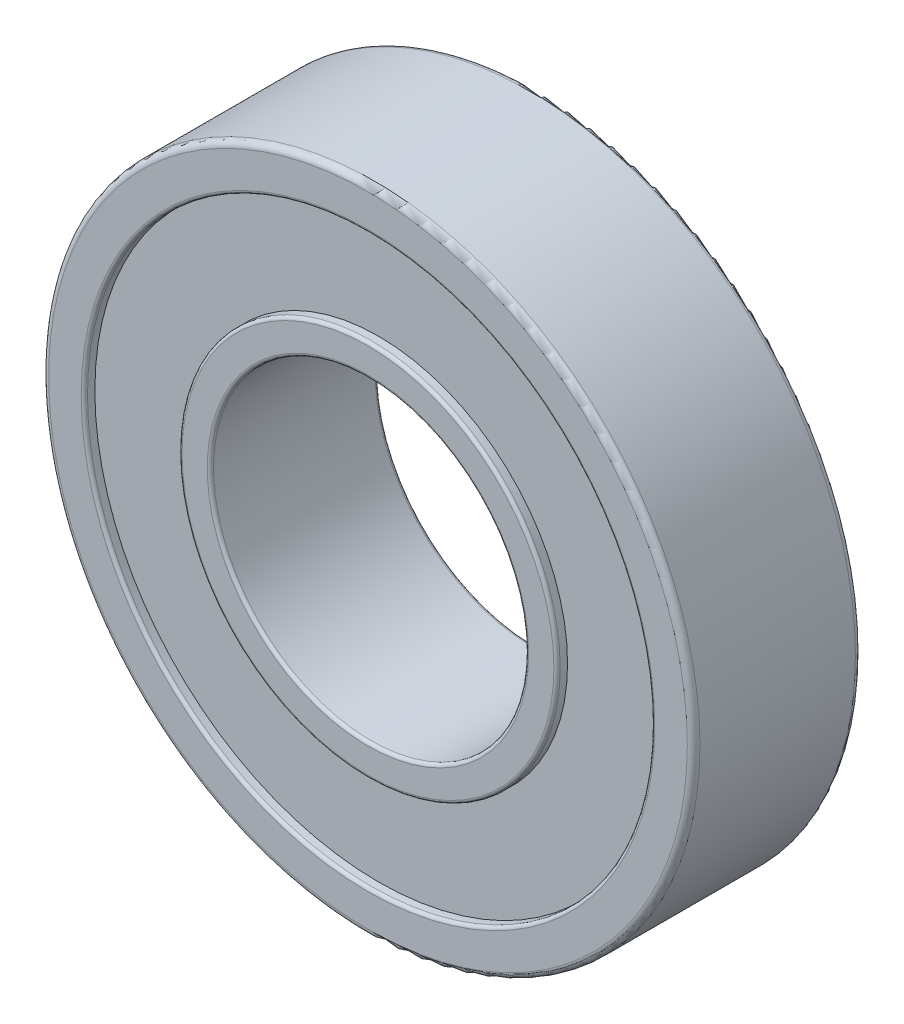
ISO-10303-21;
HEADER;
FILE_DESCRIPTION(('STEP AP214'),'2;1');
FILE_NAME('part.step','',(''),(''),'','','');
FILE_SCHEMA(('AUTOMOTIVE_DESIGN { 1 0 10303 214 1 1 1 1 }'));
ENDSEC;
DATA;
#1=APPLICATION_CONTEXT('core data for automotive mechanical design processes');
#2=APPLICATION_PROTOCOL_DEFINITION('international standard','automotive_design',2000,#1);
#3=PRODUCT_CONTEXT('',#1,'mechanical');
#4=PRODUCT('Part','Part','',(#3));
#5=PRODUCT_RELATED_PRODUCT_CATEGORY('part','',(#4));
#6=PRODUCT_DEFINITION_FORMATION('','',#4);
#7=PRODUCT_DEFINITION_CONTEXT('part definition',#1,'design');
#8=PRODUCT_DEFINITION('design','',#6,#7);
#9=PRODUCT_DEFINITION_SHAPE('','',#8);
#10=(LENGTH_UNIT() NAMED_UNIT(*) SI_UNIT(.MILLI.,.METRE.));
#11=(NAMED_UNIT(*) PLANE_ANGLE_UNIT() SI_UNIT($,.RADIAN.));
#12=(NAMED_UNIT(*) SI_UNIT($,.STERADIAN.) SOLID_ANGLE_UNIT());
#13=UNCERTAINTY_MEASURE_WITH_UNIT(LENGTH_MEASURE(1.E-05),#10,'distance_accuracy_value','');
#14=(GEOMETRIC_REPRESENTATION_CONTEXT(3) GLOBAL_UNCERTAINTY_ASSIGNED_CONTEXT((#13)) GLOBAL_UNIT_ASSIGNED_CONTEXT((#10,
#11,#12)) REPRESENTATION_CONTEXT('',''));
#15=CARTESIAN_POINT('',(0.,0.,0.));
#16=DIRECTION('',(0.,0.,1.));
#17=DIRECTION('',(1.,0.,0.));
#18=AXIS2_PLACEMENT_3D('',#15,#16,#17);
#19=CARTESIAN_POINT('',(0.,0.,16.));
#20=DIRECTION('',(0.,0.,1.));
#21=DIRECTION('',(1.,0.,0.));
#22=AXIS2_PLACEMENT_3D('',#19,#20,#21);
#23=PLANE('',#22);
#24=CARTESIAN_POINT('',(0.,0.,16.));
#25=DIRECTION('',(0.,0.,1.));
#26=DIRECTION('',(1.,0.,0.));
#27=AXIS2_PLACEMENT_3D('',#24,#25,#26);
#28=CIRCLE('',#27,15.3);
#29=CARTESIAN_POINT('',(15.3,0.,16.));
#30=VERTEX_POINT('',#29);
#31=EDGE_CURVE('E65',#30,#30,#28,.F.);
#32=ORIENTED_EDGE('',*,*,#31,.T.);
#33=EDGE_LOOP('',(#32));
#34=FACE_BOUND('',#33,.T.);
#35=CARTESIAN_POINT('',(0.,0.,16.));
#36=DIRECTION('',(0.,0.,1.));
#37=DIRECTION('',(1.,0.,0.));
#38=AXIS2_PLACEMENT_3D('',#35,#36,#37);
#39=CIRCLE('',#38,17.7);
#40=CARTESIAN_POINT('',(17.7,0.,16.));
#41=VERTEX_POINT('',#40);
#42=EDGE_CURVE('E68',#41,#41,#39,.T.);
#43=ORIENTED_EDGE('',*,*,#42,.T.);
#44=EDGE_LOOP('',(#43));
#45=FACE_BOUND('',#44,.T.);
#46=ADVANCED_FACE('F33',(#34,#45),#23,.T.);
#47=CARTESIAN_POINT('',(0.,0.,0.));
#48=DIRECTION('',(0.,0.,1.));
#49=DIRECTION('',(1.,0.,0.));
#50=AXIS2_PLACEMENT_3D('',#47,#48,#49);
#51=PLANE('',#50);
#52=CARTESIAN_POINT('',(0.,0.,0.));
#53=DIRECTION('',(0.,0.,1.));
#54=DIRECTION('',(1.,0.,0.));
#55=AXIS2_PLACEMENT_3D('',#52,#53,#54);
#56=CIRCLE('',#55,15.3);
#57=CARTESIAN_POINT('',(15.3,0.,0.));
#58=VERTEX_POINT('',#57);
#59=EDGE_CURVE('E48',#58,#58,#56,.T.);
#60=ORIENTED_EDGE('',*,*,#59,.T.);
#61=EDGE_LOOP('',(#60));
#62=FACE_BOUND('',#61,.T.);
#63=CARTESIAN_POINT('',(0.,0.,0.));
#64=DIRECTION('',(0.,0.,1.));
#65=DIRECTION('',(1.,0.,0.));
#66=AXIS2_PLACEMENT_3D('',#63,#64,#65);
#67=CIRCLE('',#66,17.7);
#68=CARTESIAN_POINT('',(17.7,0.,0.));
#69=VERTEX_POINT('',#68);
#70=EDGE_CURVE('E53',#69,#69,#67,.F.);
#71=ORIENTED_EDGE('',*,*,#70,.T.);
#72=EDGE_LOOP('',(#71));
#73=FACE_BOUND('',#72,.T.);
#74=ADVANCED_FACE('F122',(#62,#73),#51,.F.);
#75=CARTESIAN_POINT('',(0.,0.,16.));
#76=DIRECTION('',(0.,0.,1.));
#77=DIRECTION('',(1.,0.,0.));
#78=AXIS2_PLACEMENT_3D('',#75,#76,#77);
#79=CIRCLE('',#78,27.3);
#80=CARTESIAN_POINT('',(27.3,0.,16.));
#81=VERTEX_POINT('',#80);
#82=EDGE_CURVE('E56',#81,#81,#79,.F.);
#83=ORIENTED_EDGE('',*,*,#82,.T.);
#84=EDGE_LOOP('',(#83));
#85=FACE_BOUND('',#84,.T.);
#86=CARTESIAN_POINT('',(0.,0.,16.));
#87=DIRECTION('',(0.,0.,1.));
#88=DIRECTION('',(1.,0.,0.));
#89=AXIS2_PLACEMENT_3D('',#86,#87,#88);
#90=CIRCLE('',#89,30.4);
#91=CARTESIAN_POINT('',(30.4,0.,16.));
#92=VERTEX_POINT('',#91);
#93=EDGE_CURVE('E86',#92,#92,#90,.T.);
#94=ORIENTED_EDGE('',*,*,#93,.T.);
#95=EDGE_LOOP('',(#94));
#96=FACE_BOUND('',#95,.T.);
#97=ADVANCED_FACE('F125',(#85,#96),#23,.T.);
#98=CARTESIAN_POINT('',(0.,0.,0.));
#99=DIRECTION('',(0.,0.,1.));
#100=DIRECTION('',(1.,0.,0.));
#101=AXIS2_PLACEMENT_3D('',#98,#99,#100);
#102=CIRCLE('',#101,27.3);
#103=CARTESIAN_POINT('',(27.3,0.,0.));
#104=VERTEX_POINT('',#103);
#105=EDGE_CURVE('E10',#104,#104,#102,.T.);
#106=ORIENTED_EDGE('',*,*,#105,.T.);
#107=EDGE_LOOP('',(#106));
#108=FACE_BOUND('',#107,.T.);
#109=CARTESIAN_POINT('',(0.,0.,0.));
#110=DIRECTION('',(0.,0.,1.));
#111=DIRECTION('',(1.,0.,0.));
#112=AXIS2_PLACEMENT_3D('',#109,#110,#111);
#113=CIRCLE('',#112,30.4);
#114=CARTESIAN_POINT('',(30.4,0.,0.));
#115=VERTEX_POINT('',#114);
#116=EDGE_CURVE('E77',#115,#115,#113,.F.);
#117=ORIENTED_EDGE('',*,*,#116,.T.);
#118=EDGE_LOOP('',(#117));
#119=FACE_BOUND('',#118,.T.);
#120=ADVANCED_FACE('F131',(#108,#119),#51,.F.);
#121=CARTESIAN_POINT('',(0.,0.,16.));
#122=DIRECTION('',(0.,0.,-1.));
#123=DIRECTION('',(-1.,0.,0.));
#124=AXIS2_PLACEMENT_3D('',#121,#122,#123);
#125=CYLINDRICAL_SURFACE('',#124,31.);
#126=CARTESIAN_POINT('',(0.,0.,15.4));
#127=DIRECTION('',(0.,0.,1.));
#128=DIRECTION('',(1.,0.,0.));
#129=AXIS2_PLACEMENT_3D('',#126,#127,#128);
#130=CIRCLE('',#129,31.);
#131=CARTESIAN_POINT('',(31.,0.,15.4));
#132=VERTEX_POINT('',#131);
#133=EDGE_CURVE('E80',#132,#132,#130,.F.);
#134=ORIENTED_EDGE('',*,*,#133,.T.);
#135=EDGE_LOOP('',(#134));
#136=FACE_BOUND('',#135,.T.);
#137=CARTESIAN_POINT('',(0.,0.,0.6));
#138=DIRECTION('',(0.,0.,1.));
#139=DIRECTION('',(1.,0.,0.));
#140=AXIS2_PLACEMENT_3D('',#137,#138,#139);
#141=CIRCLE('',#140,31.);
#142=CARTESIAN_POINT('',(31.,0.,0.6));
#143=VERTEX_POINT('',#142);
#144=EDGE_CURVE('E83',#143,#143,#141,.T.);
#145=ORIENTED_EDGE('',*,*,#144,.T.);
#146=EDGE_LOOP('',(#145));
#147=FACE_BOUND('',#146,.T.);
#148=ADVANCED_FACE('F139',(#136,#147),#125,.T.);
#149=CARTESIAN_POINT('',(0.,0.,16.));
#150=DIRECTION('',(0.,0.,-1.));
#151=DIRECTION('',(-1.,0.,0.));
#152=AXIS2_PLACEMENT_3D('',#149,#150,#151);
#153=CYLINDRICAL_SURFACE('',#152,15.);
#154=CARTESIAN_POINT('',(0.,0.,15.7));
#155=DIRECTION('',(0.,0.,1.));
#156=DIRECTION('',(1.,0.,0.));
#157=AXIS2_PLACEMENT_3D('',#154,#155,#156);
#158=CIRCLE('',#157,15.);
#159=CARTESIAN_POINT('',(15.,0.,15.7));
#160=VERTEX_POINT('',#159);
#161=EDGE_CURVE('E71',#160,#160,#158,.T.);
#162=ORIENTED_EDGE('',*,*,#161,.T.);
#163=EDGE_LOOP('',(#162));
#164=FACE_BOUND('',#163,.T.);
#165=CARTESIAN_POINT('',(0.,0.,0.300000000000002));
#166=DIRECTION('',(0.,0.,1.));
#167=DIRECTION('',(1.,0.,0.));
#168=AXIS2_PLACEMENT_3D('',#165,#166,#167);
#169=CIRCLE('',#168,15.);
#170=CARTESIAN_POINT('',(15.,0.,0.300000000000002));
#171=VERTEX_POINT('',#170);
#172=EDGE_CURVE('E74',#171,#171,#169,.F.);
#173=ORIENTED_EDGE('',*,*,#172,.T.);
#174=EDGE_LOOP('',(#173));
#175=FACE_BOUND('',#174,.T.);
#176=ADVANCED_FACE('F196',(#164,#175),#153,.F.);
#177=CARTESIAN_POINT('',(0.,0.,1.));
#178=DIRECTION('',(0.,0.,-1.));
#179=DIRECTION('',(-1.,0.,0.));
#180=AXIS2_PLACEMENT_3D('',#177,#178,#179);
#181=CYLINDRICAL_SURFACE('',#180,27.);
#182=CARTESIAN_POINT('',(0.,0.,0.3));
#183=DIRECTION('',(0.,0.,1.));
#184=DIRECTION('',(1.,0.,0.));
#185=AXIS2_PLACEMENT_3D('',#182,#183,#184);
#186=CIRCLE('',#185,27.);
#187=CARTESIAN_POINT('',(27.,0.,0.3));
#188=VERTEX_POINT('',#187);
#189=EDGE_CURVE('E40',#188,#188,#186,.F.);
#190=ORIENTED_EDGE('',*,*,#189,.T.);
#191=EDGE_LOOP('',(#190));
#192=FACE_BOUND('',#191,.T.);
#193=CARTESIAN_POINT('',(0.,0.,1.));
#194=DIRECTION('',(0.,0.,-1.));
#195=DIRECTION('',(-1.,0.,0.));
#196=AXIS2_PLACEMENT_3D('',#193,#194,#195);
#197=CIRCLE('',#196,27.);
#198=CARTESIAN_POINT('',(-27.,0.,1.));
#199=VERTEX_POINT('',#198);
#200=EDGE_CURVE('E89',#199,#199,#197,.T.);
#201=ORIENTED_EDGE('',*,*,#200,.F.);
#202=EDGE_LOOP('',(#201));
#203=FACE_BOUND('',#202,.T.);
#204=ADVANCED_FACE('F191',(#192,#203),#181,.F.);
#205=CARTESIAN_POINT('',(0.,0.,1.));
#206=DIRECTION('',(0.,0.,-1.));
#207=DIRECTION('',(-1.,0.,0.));
#208=AXIS2_PLACEMENT_3D('',#205,#206,#207);
#209=PLANE('',#208);
#210=CARTESIAN_POINT('',(0.,0.,1.));
#211=DIRECTION('',(0.,0.,-1.));
#212=DIRECTION('',(-1.,0.,0.));
#213=AXIS2_PLACEMENT_3D('',#210,#211,#212);
#214=CIRCLE('',#213,18.);
#215=CARTESIAN_POINT('',(-18.,0.,1.));
#216=VERTEX_POINT('',#215);
#217=EDGE_CURVE('E92',#216,#216,#214,.T.);
#218=ORIENTED_EDGE('',*,*,#217,.F.);
#219=EDGE_LOOP('',(#218));
#220=FACE_BOUND('',#219,.T.);
#221=ORIENTED_EDGE('',*,*,#200,.T.);
#222=EDGE_LOOP('',(#221));
#223=FACE_BOUND('',#222,.T.);
#224=ADVANCED_FACE('F118',(#220,#223),#209,.T.);
#225=CARTESIAN_POINT('',(0.,0.,1.));
#226=DIRECTION('',(0.,0.,-1.));
#227=DIRECTION('',(-1.,0.,0.));
#228=AXIS2_PLACEMENT_3D('',#225,#226,#227);
#229=CYLINDRICAL_SURFACE('',#228,18.);
#230=CARTESIAN_POINT('',(0.,0.,0.3));
#231=DIRECTION('',(0.,0.,1.));
#232=DIRECTION('',(1.,0.,0.));
#233=AXIS2_PLACEMENT_3D('',#230,#231,#232);
#234=CIRCLE('',#233,18.);
#235=CARTESIAN_POINT('',(18.,0.,0.3));
#236=VERTEX_POINT('',#235);
#237=EDGE_CURVE('E44',#236,#236,#234,.T.);
#238=ORIENTED_EDGE('',*,*,#237,.T.);
#239=EDGE_LOOP('',(#238));
#240=FACE_BOUND('',#239,.T.);
#241=ORIENTED_EDGE('',*,*,#217,.T.);
#242=EDGE_LOOP('',(#241));
#243=FACE_BOUND('',#242,.T.);
#244=ADVANCED_FACE('F112',(#240,#243),#229,.T.);
#245=CARTESIAN_POINT('',(0.,0.,15.));
#246=DIRECTION('',(0.,0.,1.));
#247=DIRECTION('',(1.,0.,0.));
#248=AXIS2_PLACEMENT_3D('',#245,#246,#247);
#249=CYLINDRICAL_SURFACE('',#248,27.);
#250=CARTESIAN_POINT('',(0.,0.,15.7));
#251=DIRECTION('',(0.,0.,1.));
#252=DIRECTION('',(1.,0.,0.));
#253=AXIS2_PLACEMENT_3D('',#250,#251,#252);
#254=CIRCLE('',#253,27.);
#255=CARTESIAN_POINT('',(27.,0.,15.7));
#256=VERTEX_POINT('',#255);
#257=EDGE_CURVE('E59',#256,#256,#254,.T.);
#258=ORIENTED_EDGE('',*,*,#257,.T.);
#259=EDGE_LOOP('',(#258));
#260=FACE_BOUND('',#259,.T.);
#261=CARTESIAN_POINT('',(0.,0.,15.));
#262=DIRECTION('',(0.,0.,1.));
#263=DIRECTION('',(1.,0.,0.));
#264=AXIS2_PLACEMENT_3D('',#261,#262,#263);
#265=CIRCLE('',#264,27.);
#266=CARTESIAN_POINT('',(27.,0.,15.));
#267=VERTEX_POINT('',#266);
#268=EDGE_CURVE('E95',#267,#267,#265,.T.);
#269=ORIENTED_EDGE('',*,*,#268,.F.);
#270=EDGE_LOOP('',(#269));
#271=FACE_BOUND('',#270,.T.);
#272=ADVANCED_FACE('F107',(#260,#271),#249,.F.);
#273=CARTESIAN_POINT('',(0.,0.,15.));
#274=DIRECTION('',(0.,0.,1.));
#275=DIRECTION('',(1.,0.,0.));
#276=AXIS2_PLACEMENT_3D('',#273,#274,#275);
#277=PLANE('',#276);
#278=CARTESIAN_POINT('',(0.,0.,15.));
#279=DIRECTION('',(0.,0.,1.));
#280=DIRECTION('',(1.,0.,0.));
#281=AXIS2_PLACEMENT_3D('',#278,#279,#280);
#282=CIRCLE('',#281,18.);
#283=CARTESIAN_POINT('',(18.,0.,15.));
#284=VERTEX_POINT('',#283);
#285=EDGE_CURVE('E98',#284,#284,#282,.T.);
#286=ORIENTED_EDGE('',*,*,#285,.F.);
#287=EDGE_LOOP('',(#286));
#288=FACE_BOUND('',#287,.T.);
#289=ORIENTED_EDGE('',*,*,#268,.T.);
#290=EDGE_LOOP('',(#289));
#291=FACE_BOUND('',#290,.T.);
#292=ADVANCED_FACE('F104',(#288,#291),#277,.T.);
#293=CARTESIAN_POINT('',(0.,0.,15.));
#294=DIRECTION('',(0.,0.,1.));
#295=DIRECTION('',(1.,0.,0.));
#296=AXIS2_PLACEMENT_3D('',#293,#294,#295);
#297=CYLINDRICAL_SURFACE('',#296,18.);
#298=CARTESIAN_POINT('',(0.,0.,15.7));
#299=DIRECTION('',(0.,0.,1.));
#300=DIRECTION('',(1.,0.,0.));
#301=AXIS2_PLACEMENT_3D('',#298,#299,#300);
#302=CIRCLE('',#301,18.);
#303=CARTESIAN_POINT('',(18.,0.,15.7));
#304=VERTEX_POINT('',#303);
#305=EDGE_CURVE('E62',#304,#304,#302,.F.);
#306=ORIENTED_EDGE('',*,*,#305,.T.);
#307=EDGE_LOOP('',(#306));
#308=FACE_BOUND('',#307,.T.);
#309=ORIENTED_EDGE('',*,*,#285,.T.);
#310=EDGE_LOOP('',(#309));
#311=FACE_BOUND('',#310,.T.);
#312=ADVANCED_FACE('F102',(#308,#311),#297,.T.);
#313=CARTESIAN_POINT('',(0.,0.,15.4));
#314=DIRECTION('',(0.,0.,1.));
#315=DIRECTION('',(1.,0.,0.));
#316=AXIS2_PLACEMENT_3D('',#313,#314,#315);
#317=TOROIDAL_SURFACE('',#316,30.4,0.6);
#318=ORIENTED_EDGE('',*,*,#133,.F.);
#319=EDGE_LOOP('',(#318));
#320=FACE_BOUND('',#319,.T.);
#321=ORIENTED_EDGE('',*,*,#93,.F.);
#322=EDGE_LOOP('',(#321));
#323=FACE_BOUND('',#322,.T.);
#324=ADVANCED_FACE('F144',(#320,#323),#317,.T.);
#325=CARTESIAN_POINT('',(0.,0.,0.6));
#326=DIRECTION('',(0.,0.,1.));
#327=DIRECTION('',(1.,0.,0.));
#328=AXIS2_PLACEMENT_3D('',#325,#326,#327);
#329=TOROIDAL_SURFACE('',#328,30.4,0.6);
#330=ORIENTED_EDGE('',*,*,#116,.F.);
#331=EDGE_LOOP('',(#330));
#332=FACE_BOUND('',#331,.T.);
#333=ORIENTED_EDGE('',*,*,#144,.F.);
#334=EDGE_LOOP('',(#333));
#335=FACE_BOUND('',#334,.T.);
#336=ADVANCED_FACE('F146',(#332,#335),#329,.T.);
#337=CARTESIAN_POINT('',(0.,0.,15.7));
#338=DIRECTION('',(0.,0.,1.));
#339=DIRECTION('',(1.,0.,0.));
#340=AXIS2_PLACEMENT_3D('',#337,#338,#339);
#341=TOROIDAL_SURFACE('',#340,15.3,0.3);
#342=ORIENTED_EDGE('',*,*,#31,.F.);
#343=EDGE_LOOP('',(#342));
#344=FACE_BOUND('',#343,.T.);
#345=ORIENTED_EDGE('',*,*,#161,.F.);
#346=EDGE_LOOP('',(#345));
#347=FACE_BOUND('',#346,.T.);
#348=ADVANCED_FACE('F153',(#344,#347),#341,.T.);
#349=CARTESIAN_POINT('',(0.,0.,15.7));
#350=DIRECTION('',(0.,0.,1.));
#351=DIRECTION('',(1.,0.,0.));
#352=AXIS2_PLACEMENT_3D('',#349,#350,#351);
#353=TOROIDAL_SURFACE('',#352,17.7,0.3);
#354=ORIENTED_EDGE('',*,*,#305,.F.);
#355=EDGE_LOOP('',(#354));
#356=FACE_BOUND('',#355,.T.);
#357=ORIENTED_EDGE('',*,*,#42,.F.);
#358=EDGE_LOOP('',(#357));
#359=FACE_BOUND('',#358,.T.);
#360=ADVANCED_FACE('F163',(#356,#359),#353,.T.);
#361=CARTESIAN_POINT('',(0.,0.,15.7));
#362=DIRECTION('',(0.,0.,1.));
#363=DIRECTION('',(1.,0.,0.));
#364=AXIS2_PLACEMENT_3D('',#361,#362,#363);
#365=TOROIDAL_SURFACE('',#364,27.3,0.3);
#366=ORIENTED_EDGE('',*,*,#82,.F.);
#367=EDGE_LOOP('',(#366));
#368=FACE_BOUND('',#367,.T.);
#369=ORIENTED_EDGE('',*,*,#257,.F.);
#370=EDGE_LOOP('',(#369));
#371=FACE_BOUND('',#370,.T.);
#372=ADVANCED_FACE('F167',(#368,#371),#365,.T.);
#373=CARTESIAN_POINT('',(0.,0.,0.300000000000002));
#374=DIRECTION('',(0.,0.,1.));
#375=DIRECTION('',(1.,0.,0.));
#376=AXIS2_PLACEMENT_3D('',#373,#374,#375);
#377=TOROIDAL_SURFACE('',#376,15.3,0.3);
#378=ORIENTED_EDGE('',*,*,#172,.F.);
#379=EDGE_LOOP('',(#378));
#380=FACE_BOUND('',#379,.T.);
#381=ORIENTED_EDGE('',*,*,#59,.F.);
#382=EDGE_LOOP('',(#381));
#383=FACE_BOUND('',#382,.T.);
#384=ADVANCED_FACE('F171',(#380,#383),#377,.T.);
#385=CARTESIAN_POINT('',(0.,0.,0.3));
#386=DIRECTION('',(0.,0.,1.));
#387=DIRECTION('',(1.,0.,0.));
#388=AXIS2_PLACEMENT_3D('',#385,#386,#387);
#389=TOROIDAL_SURFACE('',#388,17.7,0.3);
#390=ORIENTED_EDGE('',*,*,#237,.F.);
#391=EDGE_LOOP('',(#390));
#392=FACE_BOUND('',#391,.T.);
#393=ORIENTED_EDGE('',*,*,#70,.F.);
#394=EDGE_LOOP('',(#393));
#395=FACE_BOUND('',#394,.T.);
#396=ADVANCED_FACE('F174',(#392,#395),#389,.T.);
#397=CARTESIAN_POINT('',(0.,0.,0.3));
#398=DIRECTION('',(0.,0.,1.));
#399=DIRECTION('',(1.,0.,0.));
#400=AXIS2_PLACEMENT_3D('',#397,#398,#399);
#401=TOROIDAL_SURFACE('',#400,27.3,0.3);
#402=ORIENTED_EDGE('',*,*,#105,.F.);
#403=EDGE_LOOP('',(#402));
#404=FACE_BOUND('',#403,.T.);
#405=ORIENTED_EDGE('',*,*,#189,.F.);
#406=EDGE_LOOP('',(#405));
#407=FACE_BOUND('',#406,.T.);
#408=ADVANCED_FACE('F35',(#404,#407),#401,.T.);
#409=CLOSED_SHELL('',(#46,#74,#97,#120,#148,#176,#204,#224,#244,#272,#292,#312,#324,#336,#348,
#360,#372,#384,#396,#408));
#410=MANIFOLD_SOLID_BREP('B2',#409);
#411=ADVANCED_BREP_SHAPE_REPRESENTATION('',(#18,#410),#14);
#412=SHAPE_DEFINITION_REPRESENTATION(#9,#411);
ENDSEC;
END-ISO-10303-21;
